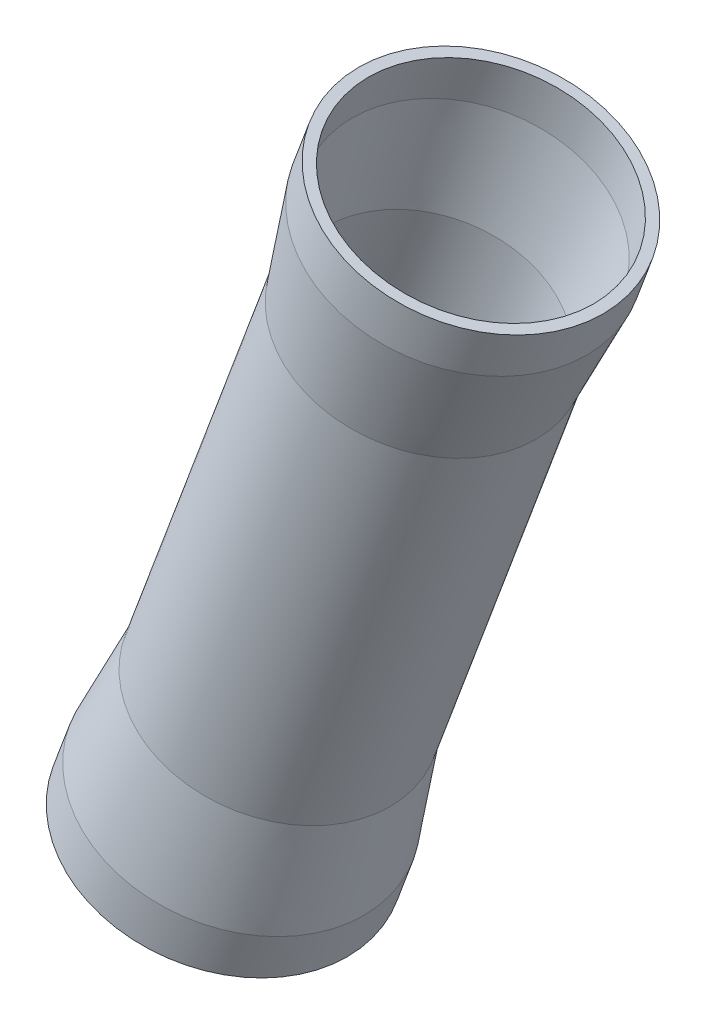
ISO-10303-21;
HEADER;
FILE_DESCRIPTION(('STEP AP214'),'2;1');
FILE_NAME('part.step','',(''),(''),'','','');
FILE_SCHEMA(('AUTOMOTIVE_DESIGN { 1 0 10303 214 1 1 1 1 }'));
ENDSEC;
DATA;
#1=APPLICATION_CONTEXT('core data for automotive mechanical design processes');
#2=APPLICATION_PROTOCOL_DEFINITION('international standard','automotive_design',2000,#1);
#3=PRODUCT_CONTEXT('',#1,'mechanical');
#4=PRODUCT('Part','Part','',(#3));
#5=PRODUCT_RELATED_PRODUCT_CATEGORY('part','',(#4));
#6=PRODUCT_DEFINITION_FORMATION('','',#4);
#7=PRODUCT_DEFINITION_CONTEXT('part definition',#1,'design');
#8=PRODUCT_DEFINITION('design','',#6,#7);
#9=PRODUCT_DEFINITION_SHAPE('','',#8);
#10=(LENGTH_UNIT() NAMED_UNIT(*) SI_UNIT(.MILLI.,.METRE.));
#11=(NAMED_UNIT(*) PLANE_ANGLE_UNIT() SI_UNIT($,.RADIAN.));
#12=(NAMED_UNIT(*) SI_UNIT($,.STERADIAN.) SOLID_ANGLE_UNIT());
#13=UNCERTAINTY_MEASURE_WITH_UNIT(LENGTH_MEASURE(1.E-05),#10,'distance_accuracy_value','');
#14=(GEOMETRIC_REPRESENTATION_CONTEXT(3) GLOBAL_UNCERTAINTY_ASSIGNED_CONTEXT((#13)) GLOBAL_UNIT_ASSIGNED_CONTEXT((#10,
#11,#12)) REPRESENTATION_CONTEXT('',''));
#15=CARTESIAN_POINT('',(0.,0.,0.));
#16=DIRECTION('',(0.,0.,1.));
#17=DIRECTION('',(1.,0.,0.));
#18=AXIS2_PLACEMENT_3D('',#15,#16,#17);
#19=CARTESIAN_POINT('',(-442.706751918456,473.564251491217,0.));
#20=DIRECTION('',(0.350007362092606,0.936746949010764,0.));
#21=DIRECTION('',(-0.936746949010764,0.350007362092606,0.));
#22=AXIS2_PLACEMENT_3D('',#19,#20,#21);
#23=PLANE('',#22);
#24=CARTESIAN_POINT('',(-419.288078193187,464.814067438901,0.));
#25=DIRECTION('',(-0.350007362092606,-0.936746949010764,0.));
#26=DIRECTION('',(0.936746949010764,-0.350007362092606,0.));
#27=AXIS2_PLACEMENT_3D('',#24,#25,#26);
#28=CIRCLE('',#27,25.);
#29=CARTESIAN_POINT('',(-395.869404467917,456.063883386586,0.));
#30=VERTEX_POINT('',#29);
#31=EDGE_CURVE('E44',#30,#30,#28,.T.);
#32=ORIENTED_EDGE('',*,*,#31,.T.);
#33=EDGE_LOOP('',(#32));
#34=FACE_BOUND('',#33,.T.);
#35=CARTESIAN_POINT('',(-419.288078193187,464.814067438901,0.));
#36=DIRECTION('',(0.350007362092606,0.936746949010764,0.));
#37=DIRECTION('',(-0.936746949010764,0.350007362092606,0.));
#38=AXIS2_PLACEMENT_3D('',#35,#36,#37);
#39=CIRCLE('',#38,23.);
#40=CARTESIAN_POINT('',(-440.833258020434,472.864236767031,0.));
#41=VERTEX_POINT('',#40);
#42=EDGE_CURVE('E51',#41,#41,#39,.F.);
#43=ORIENTED_EDGE('',*,*,#42,.F.);
#44=EDGE_LOOP('',(#43));
#45=FACE_BOUND('',#44,.T.);
#46=ADVANCED_FACE('F24',(#34,#45),#23,.F.);
#47=CARTESIAN_POINT('',(-437.599068933675,415.807199106292,0.));
#48=DIRECTION('',(-0.350007362092606,-0.936746949010764,0.));
#49=DIRECTION('',(0.936746949010764,-0.350007362092606,0.));
#50=AXIS2_PLACEMENT_3D('',#47,#48,#49);
#51=CYLINDRICAL_SURFACE('',#50,24.9999999999999);
#52=CARTESIAN_POINT('',(-373.437113759055,587.527917759312,0.));
#53=DIRECTION('',(-0.350007362092606,-0.936746949010764,0.));
#54=DIRECTION('',(0.936746949010764,-0.350007362092606,0.));
#55=AXIS2_PLACEMENT_3D('',#52,#53,#54);
#56=CIRCLE('',#55,24.9999999999999);
#57=CARTESIAN_POINT('',(-350.018440033786,578.777733706997,0.));
#58=VERTEX_POINT('',#57);
#59=EDGE_CURVE('E10',#58,#58,#56,.T.);
#60=ORIENTED_EDGE('',*,*,#59,.F.);
#61=EDGE_LOOP('',(#60));
#62=FACE_BOUND('',#61,.T.);
#63=CARTESIAN_POINT('',(-370.287047500222,595.958640300409,0.));
#64=DIRECTION('',(-0.350007362092606,-0.936746949010764,0.));
#65=DIRECTION('',(0.936746949010764,-0.350007362092606,0.));
#66=AXIS2_PLACEMENT_3D('',#63,#64,#65);
#67=CIRCLE('',#66,25.);
#68=CARTESIAN_POINT('',(-346.868373774953,587.208456248094,0.));
#69=VERTEX_POINT('',#68);
#70=EDGE_CURVE('E47',#69,#69,#67,.T.);
#71=ORIENTED_EDGE('',*,*,#70,.T.);
#72=EDGE_LOOP('',(#71));
#73=FACE_BOUND('',#72,.T.);
#74=ADVANCED_FACE('F26',(#62,#73),#51,.T.);
#75=CARTESIAN_POINT('',(-373.437113759055,587.527917759312,0.));
#76=DIRECTION('',(0.350007362092606,0.936746949010764,0.));
#77=DIRECTION('',(-0.936746949010764,0.350007362092606,0.));
#78=AXIS2_PLACEMENT_3D('',#75,#76,#77);
#79=CONICAL_SURFACE('',#78,24.9999999999999,0.118489959158133);
#80=CARTESIAN_POINT('',(-380.787268363,567.856231830085,0.));
#81=DIRECTION('',(-0.350007362092606,-0.936746949010764,0.));
#82=DIRECTION('',(0.936746949010764,-0.350007362092606,0.));
#83=AXIS2_PLACEMENT_3D('',#80,#81,#82);
#84=CIRCLE('',#83,22.5);
#85=CARTESIAN_POINT('',(-359.710462010258,559.981066183002,0.));
#86=VERTEX_POINT('',#85);
#87=EDGE_CURVE('E31',#86,#86,#84,.T.);
#88=ORIENTED_EDGE('',*,*,#87,.F.);
#89=EDGE_LOOP('',(#88));
#90=FACE_BOUND('',#89,.T.);
#91=ORIENTED_EDGE('',*,*,#59,.T.);
#92=EDGE_LOOP('',(#91));
#93=FACE_BOUND('',#92,.T.);
#94=ADVANCED_FACE('F94',(#90,#93),#79,.T.);
#95=CARTESIAN_POINT('',(-437.599068933675,415.807199106292,0.));
#96=DIRECTION('',(-0.350007362092606,-0.936746949010764,0.));
#97=DIRECTION('',(0.936746949010764,-0.350007362092606,0.));
#98=AXIS2_PLACEMENT_3D('',#95,#96,#97);
#99=CYLINDRICAL_SURFACE('',#98,22.5);
#100=CARTESIAN_POINT('',(-408.787857330408,492.916475909224,0.));
#101=DIRECTION('',(-0.350007362092606,-0.936746949010764,0.));
#102=DIRECTION('',(0.936746949010764,-0.350007362092606,0.));
#103=AXIS2_PLACEMENT_3D('',#100,#101,#102);
#104=CIRCLE('',#103,22.5);
#105=CARTESIAN_POINT('',(-387.711050977666,485.041310262141,0.));
#106=VERTEX_POINT('',#105);
#107=EDGE_CURVE('E35',#106,#106,#104,.T.);
#108=ORIENTED_EDGE('',*,*,#107,.F.);
#109=EDGE_LOOP('',(#108));
#110=FACE_BOUND('',#109,.T.);
#111=ORIENTED_EDGE('',*,*,#87,.T.);
#112=EDGE_LOOP('',(#111));
#113=FACE_BOUND('',#112,.T.);
#114=ADVANCED_FACE('F106',(#110,#113),#99,.T.);
#115=CARTESIAN_POINT('',(-408.787857330408,492.916475909224,0.));
#116=DIRECTION('',(-0.350007362092606,-0.936746949010764,0.));
#117=DIRECTION('',(0.936746949010764,-0.350007362092606,0.));
#118=AXIS2_PLACEMENT_3D('',#115,#116,#117);
#119=CONICAL_SURFACE('',#118,22.5,0.118489959158137);
#120=CARTESIAN_POINT('',(-416.138011934353,473.244789979998,0.));
#121=DIRECTION('',(-0.350007362092606,-0.936746949010764,0.));
#122=DIRECTION('',(0.936746949010764,-0.350007362092606,0.));
#123=AXIS2_PLACEMENT_3D('',#120,#121,#122);
#124=CIRCLE('',#123,24.9999999999999);
#125=CARTESIAN_POINT('',(-392.719338209084,464.494605927683,0.));
#126=VERTEX_POINT('',#125);
#127=EDGE_CURVE('E39',#126,#126,#124,.T.);
#128=ORIENTED_EDGE('',*,*,#127,.F.);
#129=EDGE_LOOP('',(#128));
#130=FACE_BOUND('',#129,.T.);
#131=ORIENTED_EDGE('',*,*,#107,.T.);
#132=EDGE_LOOP('',(#131));
#133=FACE_BOUND('',#132,.T.);
#134=ADVANCED_FACE('F102',(#130,#133),#119,.T.);
#135=CARTESIAN_POINT('',(-437.599068933675,415.807199106292,0.));
#136=DIRECTION('',(-0.350007362092606,-0.936746949010764,0.));
#137=DIRECTION('',(0.936746949010764,-0.350007362092606,0.));
#138=AXIS2_PLACEMENT_3D('',#135,#136,#137);
#139=CYLINDRICAL_SURFACE('',#138,25.);
#140=ORIENTED_EDGE('',*,*,#31,.F.);
#141=EDGE_LOOP('',(#140));
#142=FACE_BOUND('',#141,.T.);
#143=ORIENTED_EDGE('',*,*,#127,.T.);
#144=EDGE_LOOP('',(#143));
#145=FACE_BOUND('',#144,.T.);
#146=ADVANCED_FACE('F100',(#142,#145),#139,.T.);
#147=CARTESIAN_POINT('',(-393.705721225491,604.708824352724,0.));
#148=DIRECTION('',(-0.350007362092606,-0.936746949010764,0.));
#149=DIRECTION('',(0.936746949010764,-0.350007362092606,0.));
#150=AXIS2_PLACEMENT_3D('',#147,#148,#149);
#151=PLANE('',#150);
#152=CARTESIAN_POINT('',(-370.287047500222,595.958640300408,0.));
#153=DIRECTION('',(-0.350007362092606,-0.936746949010764,0.));
#154=DIRECTION('',(0.936746949010764,-0.350007362092606,0.));
#155=AXIS2_PLACEMENT_3D('',#152,#153,#154);
#156=CIRCLE('',#155,22.9999999999999);
#157=CARTESIAN_POINT('',(-348.741867672974,587.908470972278,0.));
#158=VERTEX_POINT('',#157);
#159=EDGE_CURVE('E55',#158,#158,#156,.T.);
#160=ORIENTED_EDGE('',*,*,#159,.T.);
#161=EDGE_LOOP('',(#160));
#162=FACE_BOUND('',#161,.T.);
#163=ORIENTED_EDGE('',*,*,#70,.F.);
#164=EDGE_LOOP('',(#163));
#165=FACE_BOUND('',#164,.T.);
#166=ADVANCED_FACE('F84',(#162,#165),#151,.F.);
#167=CARTESIAN_POINT('',(-437.599068933675,415.807199106292,0.));
#168=DIRECTION('',(-0.350007362092606,-0.936746949010764,0.));
#169=DIRECTION('',(0.936746949010764,-0.350007362092606,0.));
#170=AXIS2_PLACEMENT_3D('',#167,#168,#169);
#171=CYLINDRICAL_SURFACE('',#170,22.9999999999999);
#172=CARTESIAN_POINT('',(-373.395592810583,587.639042912705,0.));
#173=DIRECTION('',(0.350007362092606,0.936746949010764,0.));
#174=DIRECTION('',(-0.936746949010764,0.350007362092606,0.));
#175=AXIS2_PLACEMENT_3D('',#172,#173,#174);
#176=CIRCLE('',#175,22.9999999999999);
#177=CARTESIAN_POINT('',(-394.940772637831,595.689212240835,0.));
#178=VERTEX_POINT('',#177);
#179=EDGE_CURVE('E50',#178,#178,#176,.F.);
#180=ORIENTED_EDGE('',*,*,#179,.T.);
#181=EDGE_LOOP('',(#180));
#182=FACE_BOUND('',#181,.T.);
#183=ORIENTED_EDGE('',*,*,#159,.F.);
#184=EDGE_LOOP('',(#183));
#185=FACE_BOUND('',#184,.T.);
#186=ADVANCED_FACE('F69',(#182,#185),#171,.F.);
#187=CARTESIAN_POINT('',(-373.354362995617,587.749388886992,0.));
#188=DIRECTION('',(0.350007362092606,0.936746949010764,0.));
#189=DIRECTION('',(-0.936746949010764,0.350007362092606,0.));
#190=AXIS2_PLACEMENT_3D('',#187,#188,#189);
#191=CONICAL_SURFACE('',#190,23.01402345161,0.118489959158133);
#192=CARTESIAN_POINT('',(-380.745747414528,567.967356983478,0.));
#193=DIRECTION('',(0.350007362092606,0.936746949010764,0.));
#194=DIRECTION('',(-0.936746949010764,0.350007362092606,0.));
#195=AXIS2_PLACEMENT_3D('',#192,#193,#194);
#196=CIRCLE('',#195,20.5);
#197=CARTESIAN_POINT('',(-399.949059869249,575.142507906377,0.));
#198=VERTEX_POINT('',#197);
#199=EDGE_CURVE('E63',#198,#198,#196,.F.);
#200=ORIENTED_EDGE('',*,*,#199,.T.);
#201=EDGE_LOOP('',(#200));
#202=FACE_BOUND('',#201,.T.);
#203=ORIENTED_EDGE('',*,*,#179,.F.);
#204=EDGE_LOOP('',(#203));
#205=FACE_BOUND('',#204,.T.);
#206=ADVANCED_FACE('F72',(#202,#205),#191,.F.);
#207=CARTESIAN_POINT('',(-437.599068933675,415.807199106292,0.));
#208=DIRECTION('',(-0.350007362092606,-0.936746949010764,0.));
#209=DIRECTION('',(0.936746949010764,-0.350007362092606,0.));
#210=AXIS2_PLACEMENT_3D('',#207,#208,#209);
#211=CYLINDRICAL_SURFACE('',#210,20.5);
#212=CARTESIAN_POINT('',(-408.82937827888,492.805350755832,0.));
#213=DIRECTION('',(-0.350007362092606,-0.936746949010764,0.));
#214=DIRECTION('',(0.936746949010764,-0.350007362092606,0.));
#215=AXIS2_PLACEMENT_3D('',#212,#213,#214);
#216=CIRCLE('',#215,20.5);
#217=CARTESIAN_POINT('',(-389.62606582416,485.630199832933,0.));
#218=VERTEX_POINT('',#217);
#219=EDGE_CURVE('E60',#218,#218,#216,.T.);
#220=ORIENTED_EDGE('',*,*,#219,.T.);
#221=EDGE_LOOP('',(#220));
#222=FACE_BOUND('',#221,.T.);
#223=ORIENTED_EDGE('',*,*,#199,.F.);
#224=EDGE_LOOP('',(#223));
#225=FACE_BOUND('',#224,.T.);
#226=ADVANCED_FACE('F74',(#222,#225),#211,.F.);
#227=CARTESIAN_POINT('',(-408.870608093846,492.695004781544,0.));
#228=DIRECTION('',(-0.350007362092606,-0.936746949010764,0.));
#229=DIRECTION('',(0.936746949010764,-0.350007362092606,0.));
#230=AXIS2_PLACEMENT_3D('',#227,#228,#229);
#231=CONICAL_SURFACE('',#230,20.5140234516101,0.118489959158137);
#232=CARTESIAN_POINT('',(-416.179532882825,473.133664826605,0.));
#233=DIRECTION('',(-0.350007362092606,-0.936746949010764,0.));
#234=DIRECTION('',(0.936746949010764,-0.350007362092606,0.));
#235=AXIS2_PLACEMENT_3D('',#232,#233,#234);
#236=CIRCLE('',#235,23.);
#237=CARTESIAN_POINT('',(-394.634353055578,465.083495498475,0.));
#238=VERTEX_POINT('',#237);
#239=EDGE_CURVE('E54',#238,#238,#236,.T.);
#240=ORIENTED_EDGE('',*,*,#239,.T.);
#241=EDGE_LOOP('',(#240));
#242=FACE_BOUND('',#241,.T.);
#243=ORIENTED_EDGE('',*,*,#219,.F.);
#244=EDGE_LOOP('',(#243));
#245=FACE_BOUND('',#244,.T.);
#246=ADVANCED_FACE('F81',(#242,#245),#231,.F.);
#247=CARTESIAN_POINT('',(-437.599068933675,415.807199106292,0.));
#248=DIRECTION('',(-0.350007362092606,-0.936746949010764,0.));
#249=DIRECTION('',(0.936746949010764,-0.350007362092606,0.));
#250=AXIS2_PLACEMENT_3D('',#247,#248,#249);
#251=CYLINDRICAL_SURFACE('',#250,23.);
#252=ORIENTED_EDGE('',*,*,#42,.T.);
#253=EDGE_LOOP('',(#252));
#254=FACE_BOUND('',#253,.T.);
#255=ORIENTED_EDGE('',*,*,#239,.F.);
#256=EDGE_LOOP('',(#255));
#257=FACE_BOUND('',#256,.T.);
#258=ADVANCED_FACE('F152',(#254,#257),#251,.F.);
#259=CLOSED_SHELL('',(#46,#74,#94,#114,#134,#146,#166,#186,#206,#226,#246,#258));
#260=MANIFOLD_SOLID_BREP('B2',#259);
#261=ADVANCED_BREP_SHAPE_REPRESENTATION('',(#18,#260),#14);
#262=SHAPE_DEFINITION_REPRESENTATION(#9,#261);
ENDSEC;
END-ISO-10303-21;
